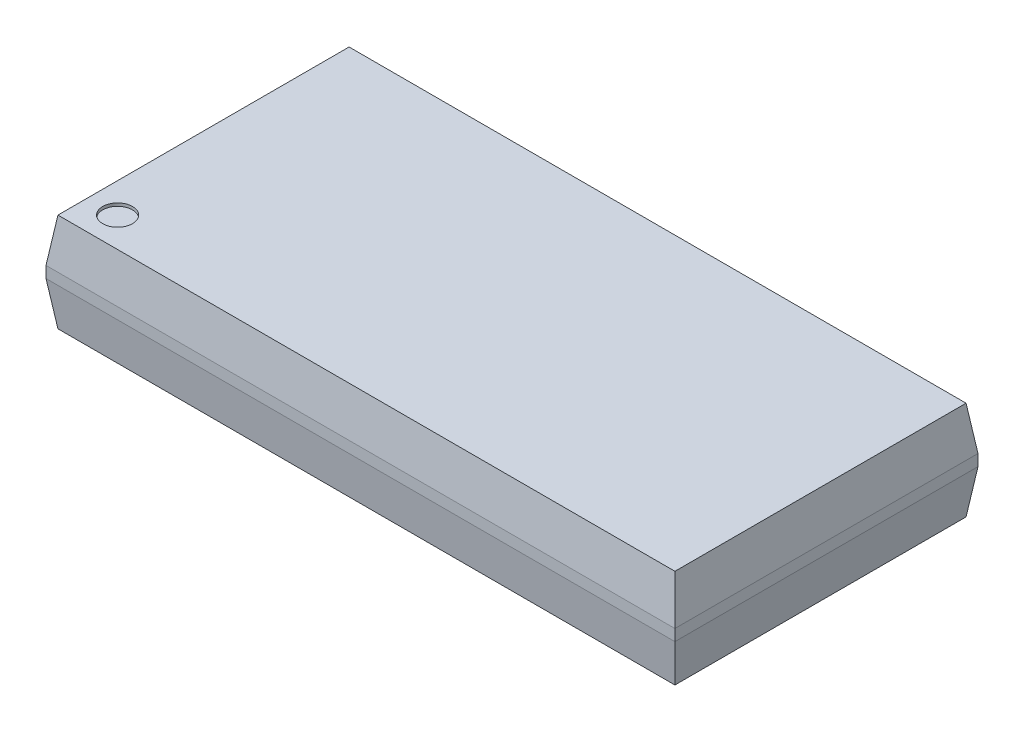
ISO-10303-21;
HEADER;
FILE_DESCRIPTION(('STEP AP214'),'2;1');
FILE_NAME('part.step','',(''),(''),'','','');
FILE_SCHEMA(('AUTOMOTIVE_DESIGN { 1 0 10303 214 1 1 1 1 }'));
ENDSEC;
DATA;
#1=APPLICATION_CONTEXT('core data for automotive mechanical design processes');
#2=APPLICATION_PROTOCOL_DEFINITION('international standard','automotive_design',2000,#1);
#3=PRODUCT_CONTEXT('',#1,'mechanical');
#4=PRODUCT('Part','Part','',(#3));
#5=PRODUCT_RELATED_PRODUCT_CATEGORY('part','',(#4));
#6=PRODUCT_DEFINITION_FORMATION('','',#4);
#7=PRODUCT_DEFINITION_CONTEXT('part definition',#1,'design');
#8=PRODUCT_DEFINITION('design','',#6,#7);
#9=PRODUCT_DEFINITION_SHAPE('','',#8);
#10=(LENGTH_UNIT() NAMED_UNIT(*) SI_UNIT(.MILLI.,.METRE.));
#11=(NAMED_UNIT(*) PLANE_ANGLE_UNIT() SI_UNIT($,.RADIAN.));
#12=(NAMED_UNIT(*) SI_UNIT($,.STERADIAN.) SOLID_ANGLE_UNIT());
#13=UNCERTAINTY_MEASURE_WITH_UNIT(LENGTH_MEASURE(1.E-05),#10,'distance_accuracy_value','');
#14=(GEOMETRIC_REPRESENTATION_CONTEXT(3) GLOBAL_UNCERTAINTY_ASSIGNED_CONTEXT((#13)) GLOBAL_UNIT_ASSIGNED_CONTEXT((#10,
#11,#12)) REPRESENTATION_CONTEXT('',''));
#15=CARTESIAN_POINT('',(0.,0.,0.));
#16=DIRECTION('',(0.,0.,1.));
#17=DIRECTION('',(1.,0.,0.));
#18=AXIS2_PLACEMENT_3D('',#15,#16,#17);
#19=CARTESIAN_POINT('',(-10.541,1.651,5.08));
#20=DIRECTION('',(1.,0.,0.));
#21=DIRECTION('',(0.,0.,-1.));
#22=AXIS2_PLACEMENT_3D('',#19,#20,#21);
#23=PLANE('',#22);
#24=DIRECTION('',(0.,-1.,0.));
#25=VECTOR('',#24,1.);
#26=CARTESIAN_POINT('',(-10.541,1.651,-5.08));
#27=LINE('',#26,#25);
#28=CARTESIAN_POINT('',(-10.541,0.1905,-5.08));
#29=VERTEX_POINT('',#28);
#30=CARTESIAN_POINT('',(-10.541,-0.1905,-5.08));
#31=VERTEX_POINT('',#30);
#32=EDGE_CURVE('E125',#29,#31,#27,.T.);
#33=ORIENTED_EDGE('',*,*,#32,.T.);
#34=DIRECTION('',(0.,0.,1.));
#35=VECTOR('',#34,1.);
#36=CARTESIAN_POINT('',(-10.541,-0.1905,-5.08));
#37=LINE('',#36,#35);
#38=CARTESIAN_POINT('',(-10.541,-0.1905,5.08));
#39=VERTEX_POINT('',#38);
#40=EDGE_CURVE('E111',#31,#39,#37,.T.);
#41=ORIENTED_EDGE('',*,*,#40,.T.);
#42=DIRECTION('',(0.,-1.,0.));
#43=VECTOR('',#42,1.);
#44=CARTESIAN_POINT('',(-10.541,1.651,5.08));
#45=LINE('',#44,#43);
#46=CARTESIAN_POINT('',(-10.541,0.1905,5.08));
#47=VERTEX_POINT('',#46);
#48=EDGE_CURVE('E123',#47,#39,#45,.T.);
#49=ORIENTED_EDGE('',*,*,#48,.F.);
#50=DIRECTION('',(0.,0.,1.));
#51=VECTOR('',#50,1.);
#52=CARTESIAN_POINT('',(-10.541,0.1905,-5.08));
#53=LINE('',#52,#51);
#54=EDGE_CURVE('E226',#29,#47,#53,.T.);
#55=ORIENTED_EDGE('',*,*,#54,.F.);
#56=EDGE_LOOP('',(#33,#41,#49,#55));
#57=FACE_BOUND('',#56,.T.);
#58=ADVANCED_FACE('F41',(#57),#23,.F.);
#59=CARTESIAN_POINT('',(0.,1.651,0.));
#60=DIRECTION('',(0.,-1.,0.));
#61=DIRECTION('',(0.,0.,-1.));
#62=AXIS2_PLACEMENT_3D('',#59,#60,#61);
#63=PLANE('',#62);
#64=CARTESIAN_POINT('',(-9.341,1.651,3.88));
#65=DIRECTION('',(0.,1.,0.));
#66=DIRECTION('',(0.,0.,1.));
#67=AXIS2_PLACEMENT_3D('',#64,#65,#66);
#68=CIRCLE('',#67,0.500000000000001);
#69=CARTESIAN_POINT('',(-9.341,1.651,4.38));
#70=VERTEX_POINT('',#69);
#71=EDGE_CURVE('E235',#70,#70,#68,.T.);
#72=ORIENTED_EDGE('',*,*,#71,.F.);
#73=EDGE_LOOP('',(#72));
#74=FACE_BOUND('',#73,.T.);
#75=DIRECTION('',(0.,0.,1.));
#76=VECTOR('',#75,1.);
#77=CARTESIAN_POINT('',(-10.341,1.651,-5.08));
#78=LINE('',#77,#76);
#79=CARTESIAN_POINT('',(-10.341,1.651,-4.88));
#80=VERTEX_POINT('',#79);
#81=CARTESIAN_POINT('',(-10.341,1.651,4.88));
#82=VERTEX_POINT('',#81);
#83=EDGE_CURVE('E57',#80,#82,#78,.T.);
#84=ORIENTED_EDGE('',*,*,#83,.T.);
#85=DIRECTION('',(1.,0.,0.));
#86=VECTOR('',#85,1.);
#87=CARTESIAN_POINT('',(-10.541,1.651,4.88));
#88=LINE('',#87,#86);
#89=CARTESIAN_POINT('',(10.341,1.651,4.88));
#90=VERTEX_POINT('',#89);
#91=EDGE_CURVE('E153',#82,#90,#88,.T.);
#92=ORIENTED_EDGE('',*,*,#91,.T.);
#93=DIRECTION('',(0.,0.,1.));
#94=VECTOR('',#93,1.);
#95=CARTESIAN_POINT('',(10.341,1.651,-5.08));
#96=LINE('',#95,#94);
#97=CARTESIAN_POINT('',(10.341,1.651,-4.88));
#98=VERTEX_POINT('',#97);
#99=EDGE_CURVE('E179',#98,#90,#96,.T.);
#100=ORIENTED_EDGE('',*,*,#99,.F.);
#101=DIRECTION('',(1.,0.,0.));
#102=VECTOR('',#101,1.);
#103=CARTESIAN_POINT('',(-10.541,1.651,-4.88));
#104=LINE('',#103,#102);
#105=EDGE_CURVE('E139',#80,#98,#104,.T.);
#106=ORIENTED_EDGE('',*,*,#105,.F.);
#107=EDGE_LOOP('',(#84,#92,#100,#106));
#108=FACE_BOUND('',#107,.T.);
#109=ADVANCED_FACE('F176',(#74,#108),#63,.F.);
#110=CARTESIAN_POINT('',(-10.541,1.651,4.88));
#111=DIRECTION('',(0.,-0.135673213556108,-0.990753641993487));
#112=DIRECTION('',(0.,0.990753641993487,-0.135673213556108));
#113=AXIS2_PLACEMENT_3D('',#110,#111,#112);
#114=PLANE('',#113);
#115=DIRECTION('',(0.134441508505806,0.981759115863646,-0.134441508505805));
#116=VECTOR('',#115,1.);
#117=CARTESIAN_POINT('',(-10.3446149038419,1.62460216469479,4.88361490384187));
#118=LINE('',#117,#116);
#119=EDGE_CURVE('E193',#47,#82,#118,.T.);
#120=ORIENTED_EDGE('',*,*,#119,.F.);
#121=DIRECTION('',(1.,0.,0.));
#122=VECTOR('',#121,1.);
#123=CARTESIAN_POINT('',(-10.541,0.1905,5.08));
#124=LINE('',#123,#122);
#125=CARTESIAN_POINT('',(10.541,0.1905,5.08));
#126=VERTEX_POINT('',#125);
#127=EDGE_CURVE('E145',#47,#126,#124,.T.);
#128=ORIENTED_EDGE('',*,*,#127,.T.);
#129=DIRECTION('',(-0.134441508505806,0.981759115863646,-0.134441508505805));
#130=VECTOR('',#129,1.);
#131=CARTESIAN_POINT('',(9.96356788987104,4.40719798421666,4.50256788987105));
#132=LINE('',#131,#130);
#133=EDGE_CURVE('E192',#126,#90,#132,.T.);
#134=ORIENTED_EDGE('',*,*,#133,.T.);
#135=ORIENTED_EDGE('',*,*,#91,.F.);
#136=EDGE_LOOP('',(#120,#128,#134,#135));
#137=FACE_BOUND('',#136,.T.);
#138=ADVANCED_FACE('F191',(#137),#114,.F.);
#139=CARTESIAN_POINT('',(-10.541,1.651,-4.88));
#140=DIRECTION('',(0.,0.135673213556108,-0.990753641993487));
#141=DIRECTION('',(0.,0.990753641993487,0.135673213556108));
#142=AXIS2_PLACEMENT_3D('',#139,#140,#141);
#143=PLANE('',#142);
#144=DIRECTION('',(1.,0.,0.));
#145=VECTOR('',#144,1.);
#146=CARTESIAN_POINT('',(-10.541,0.1905,-5.08));
#147=LINE('',#146,#145);
#148=CARTESIAN_POINT('',(10.541,0.1905,-5.08));
#149=VERTEX_POINT('',#148);
#150=EDGE_CURVE('E173',#29,#149,#147,.T.);
#151=ORIENTED_EDGE('',*,*,#150,.F.);
#152=DIRECTION('',(0.134441508505806,0.981759115863646,0.134441508505805));
#153=VECTOR('',#152,1.);
#154=CARTESIAN_POINT('',(-10.3446149038419,1.62460216469479,-4.88361490384187));
#155=LINE('',#154,#153);
#156=EDGE_CURVE('E50',#29,#80,#155,.T.);
#157=ORIENTED_EDGE('',*,*,#156,.T.);
#158=ORIENTED_EDGE('',*,*,#105,.T.);
#159=DIRECTION('',(-0.134441508505806,0.981759115863646,0.134441508505805));
#160=VECTOR('',#159,1.);
#161=CARTESIAN_POINT('',(9.96356788987104,4.40719798421666,-4.50256788987105));
#162=LINE('',#161,#160);
#163=EDGE_CURVE('E160',#149,#98,#162,.T.);
#164=ORIENTED_EDGE('',*,*,#163,.F.);
#165=EDGE_LOOP('',(#151,#157,#158,#164));
#166=FACE_BOUND('',#165,.T.);
#167=ADVANCED_FACE('F170',(#166),#143,.T.);
#168=CARTESIAN_POINT('',(10.541,1.651,5.08));
#169=DIRECTION('',(-1.,0.,0.));
#170=DIRECTION('',(0.,0.,1.));
#171=AXIS2_PLACEMENT_3D('',#168,#169,#170);
#172=PLANE('',#171);
#173=DIRECTION('',(0.,0.,1.));
#174=VECTOR('',#173,1.);
#175=CARTESIAN_POINT('',(10.541,-0.1905,-5.08));
#176=LINE('',#175,#174);
#177=CARTESIAN_POINT('',(10.541,-0.1905,-5.08));
#178=VERTEX_POINT('',#177);
#179=CARTESIAN_POINT('',(10.541,-0.1905,5.08));
#180=VERTEX_POINT('',#179);
#181=EDGE_CURVE('E198',#178,#180,#176,.T.);
#182=ORIENTED_EDGE('',*,*,#181,.F.);
#183=DIRECTION('',(0.,-1.,0.));
#184=VECTOR('',#183,1.);
#185=CARTESIAN_POINT('',(10.541,1.651,-5.08));
#186=LINE('',#185,#184);
#187=EDGE_CURVE('E151',#149,#178,#186,.T.);
#188=ORIENTED_EDGE('',*,*,#187,.F.);
#189=DIRECTION('',(0.,0.,1.));
#190=VECTOR('',#189,1.);
#191=CARTESIAN_POINT('',(10.541,0.1905,-5.08));
#192=LINE('',#191,#190);
#193=EDGE_CURVE('E200',#149,#126,#192,.T.);
#194=ORIENTED_EDGE('',*,*,#193,.T.);
#195=DIRECTION('',(0.,-1.,0.));
#196=VECTOR('',#195,1.);
#197=CARTESIAN_POINT('',(10.541,1.651,5.08));
#198=LINE('',#197,#196);
#199=EDGE_CURVE('E147',#126,#180,#198,.T.);
#200=ORIENTED_EDGE('',*,*,#199,.T.);
#201=EDGE_LOOP('',(#182,#188,#194,#200));
#202=FACE_BOUND('',#201,.T.);
#203=ADVANCED_FACE('F43',(#202),#172,.F.);
#204=CARTESIAN_POINT('',(0.,-1.651,0.));
#205=DIRECTION('',(0.,-1.,0.));
#206=DIRECTION('',(0.,0.,-1.));
#207=AXIS2_PLACEMENT_3D('',#204,#205,#206);
#208=PLANE('',#207);
#209=DIRECTION('',(0.,0.,1.));
#210=VECTOR('',#209,1.);
#211=CARTESIAN_POINT('',(-10.341,-1.651,-5.08));
#212=LINE('',#211,#210);
#213=CARTESIAN_POINT('',(-10.341,-1.651,-4.88));
#214=VERTEX_POINT('',#213);
#215=CARTESIAN_POINT('',(-10.341,-1.651,4.88));
#216=VERTEX_POINT('',#215);
#217=EDGE_CURVE('E112',#214,#216,#212,.T.);
#218=ORIENTED_EDGE('',*,*,#217,.F.);
#219=DIRECTION('',(1.,0.,0.));
#220=VECTOR('',#219,1.);
#221=CARTESIAN_POINT('',(-10.541,-1.651,-4.88));
#222=LINE('',#221,#220);
#223=CARTESIAN_POINT('',(10.341,-1.651,-4.88));
#224=VERTEX_POINT('',#223);
#225=EDGE_CURVE('E65',#214,#224,#222,.T.);
#226=ORIENTED_EDGE('',*,*,#225,.T.);
#227=DIRECTION('',(0.,0.,1.));
#228=VECTOR('',#227,1.);
#229=CARTESIAN_POINT('',(10.341,-1.651,-5.08));
#230=LINE('',#229,#228);
#231=CARTESIAN_POINT('',(10.341,-1.651,4.88));
#232=VERTEX_POINT('',#231);
#233=EDGE_CURVE('E218',#224,#232,#230,.T.);
#234=ORIENTED_EDGE('',*,*,#233,.T.);
#235=DIRECTION('',(1.,0.,0.));
#236=VECTOR('',#235,1.);
#237=CARTESIAN_POINT('',(-10.541,-1.651,4.88));
#238=LINE('',#237,#236);
#239=EDGE_CURVE('E140',#216,#232,#238,.T.);
#240=ORIENTED_EDGE('',*,*,#239,.F.);
#241=EDGE_LOOP('',(#218,#226,#234,#240));
#242=FACE_BOUND('',#241,.T.);
#243=ADVANCED_FACE('F220',(#242),#208,.T.);
#244=CARTESIAN_POINT('',(-10.541,-1.651,4.88));
#245=DIRECTION('',(0.,-0.135673213556108,0.990753641993487));
#246=DIRECTION('',(0.,-0.990753641993487,-0.135673213556108));
#247=AXIS2_PLACEMENT_3D('',#244,#245,#246);
#248=PLANE('',#247);
#249=DIRECTION('',(-0.134441508505806,0.981759115863646,0.134441508505805));
#250=VECTOR('',#249,1.);
#251=CARTESIAN_POINT('',(-10.3446149038419,-1.62460216469479,4.88361490384187));
#252=LINE('',#251,#250);
#253=EDGE_CURVE('E108',#216,#39,#252,.T.);
#254=ORIENTED_EDGE('',*,*,#253,.F.);
#255=ORIENTED_EDGE('',*,*,#239,.T.);
#256=DIRECTION('',(0.134441508505806,0.981759115863646,0.134441508505805));
#257=VECTOR('',#256,1.);
#258=CARTESIAN_POINT('',(9.96356788987104,-4.40719798421666,4.50256788987105));
#259=LINE('',#258,#257);
#260=EDGE_CURVE('E134',#232,#180,#259,.T.);
#261=ORIENTED_EDGE('',*,*,#260,.T.);
#262=DIRECTION('',(1.,0.,0.));
#263=VECTOR('',#262,1.);
#264=CARTESIAN_POINT('',(-10.541,-0.1905,5.08));
#265=LINE('',#264,#263);
#266=EDGE_CURVE('E131',#39,#180,#265,.T.);
#267=ORIENTED_EDGE('',*,*,#266,.F.);
#268=EDGE_LOOP('',(#254,#255,#261,#267));
#269=FACE_BOUND('',#268,.T.);
#270=ADVANCED_FACE('F132',(#269),#248,.T.);
#271=CARTESIAN_POINT('',(-10.541,-1.651,-4.88));
#272=DIRECTION('',(0.,0.135673213556108,0.990753641993487));
#273=DIRECTION('',(0.,-0.990753641993487,0.135673213556108));
#274=AXIS2_PLACEMENT_3D('',#271,#272,#273);
#275=PLANE('',#274);
#276=ORIENTED_EDGE('',*,*,#225,.F.);
#277=DIRECTION('',(-0.134441508505806,0.981759115863646,-0.134441508505805));
#278=VECTOR('',#277,1.);
#279=CARTESIAN_POINT('',(-10.3446149038419,-1.62460216469479,-4.88361490384187));
#280=LINE('',#279,#278);
#281=EDGE_CURVE('E11',#214,#31,#280,.T.);
#282=ORIENTED_EDGE('',*,*,#281,.T.);
#283=DIRECTION('',(1.,0.,0.));
#284=VECTOR('',#283,1.);
#285=CARTESIAN_POINT('',(-10.541,-0.1905,-5.08));
#286=LINE('',#285,#284);
#287=EDGE_CURVE('E211',#31,#178,#286,.T.);
#288=ORIENTED_EDGE('',*,*,#287,.T.);
#289=DIRECTION('',(0.134441508505806,0.981759115863646,-0.134441508505805));
#290=VECTOR('',#289,1.);
#291=CARTESIAN_POINT('',(9.96356788987104,-4.40719798421666,-4.50256788987105));
#292=LINE('',#291,#290);
#293=EDGE_CURVE('E164',#224,#178,#292,.T.);
#294=ORIENTED_EDGE('',*,*,#293,.F.);
#295=EDGE_LOOP('',(#276,#282,#288,#294));
#296=FACE_BOUND('',#295,.T.);
#297=ADVANCED_FACE('F265',(#296),#275,.F.);
#298=CARTESIAN_POINT('',(-10.541,1.651,5.08));
#299=DIRECTION('',(0.,0.,-1.));
#300=DIRECTION('',(-1.,0.,0.));
#301=AXIS2_PLACEMENT_3D('',#298,#299,#300);
#302=PLANE('',#301);
#303=ORIENTED_EDGE('',*,*,#266,.T.);
#304=ORIENTED_EDGE('',*,*,#199,.F.);
#305=ORIENTED_EDGE('',*,*,#127,.F.);
#306=ORIENTED_EDGE('',*,*,#48,.T.);
#307=EDGE_LOOP('',(#303,#304,#305,#306));
#308=FACE_BOUND('',#307,.T.);
#309=ADVANCED_FACE('F143',(#308),#302,.F.);
#310=CARTESIAN_POINT('',(-10.541,1.651,-5.08));
#311=DIRECTION('',(0.,0.,1.));
#312=DIRECTION('',(1.,0.,0.));
#313=AXIS2_PLACEMENT_3D('',#310,#311,#312);
#314=PLANE('',#313);
#315=ORIENTED_EDGE('',*,*,#187,.T.);
#316=ORIENTED_EDGE('',*,*,#287,.F.);
#317=ORIENTED_EDGE('',*,*,#32,.F.);
#318=ORIENTED_EDGE('',*,*,#150,.T.);
#319=EDGE_LOOP('',(#315,#316,#317,#318));
#320=FACE_BOUND('',#319,.T.);
#321=ADVANCED_FACE('F264',(#320),#314,.F.);
#322=CARTESIAN_POINT('',(10.341,1.651,-5.08));
#323=DIRECTION('',(-0.990753641993487,-0.135673213556109,0.));
#324=DIRECTION('',(0.13567321355611,-0.990753641993487,0.));
#325=AXIS2_PLACEMENT_3D('',#322,#323,#324);
#326=PLANE('',#325);
#327=ORIENTED_EDGE('',*,*,#193,.F.);
#328=ORIENTED_EDGE('',*,*,#163,.T.);
#329=ORIENTED_EDGE('',*,*,#99,.T.);
#330=ORIENTED_EDGE('',*,*,#133,.F.);
#331=EDGE_LOOP('',(#327,#328,#329,#330));
#332=FACE_BOUND('',#331,.T.);
#333=ADVANCED_FACE('F267',(#332),#326,.F.);
#334=CARTESIAN_POINT('',(10.341,-1.651,-5.08));
#335=DIRECTION('',(0.990753641993487,-0.135673213556109,0.));
#336=DIRECTION('',(0.13567321355611,0.990753641993487,0.));
#337=AXIS2_PLACEMENT_3D('',#334,#335,#336);
#338=PLANE('',#337);
#339=ORIENTED_EDGE('',*,*,#233,.F.);
#340=ORIENTED_EDGE('',*,*,#293,.T.);
#341=ORIENTED_EDGE('',*,*,#181,.T.);
#342=ORIENTED_EDGE('',*,*,#260,.F.);
#343=EDGE_LOOP('',(#339,#340,#341,#342));
#344=FACE_BOUND('',#343,.T.);
#345=ADVANCED_FACE('F217',(#344),#338,.T.);
#346=CARTESIAN_POINT('',(-10.341,1.651,-5.08));
#347=DIRECTION('',(-0.990753641993487,0.135673213556109,0.));
#348=DIRECTION('',(-0.13567321355611,-0.990753641993487,0.));
#349=AXIS2_PLACEMENT_3D('',#346,#347,#348);
#350=PLANE('',#349);
#351=ORIENTED_EDGE('',*,*,#119,.T.);
#352=ORIENTED_EDGE('',*,*,#83,.F.);
#353=ORIENTED_EDGE('',*,*,#156,.F.);
#354=ORIENTED_EDGE('',*,*,#54,.T.);
#355=EDGE_LOOP('',(#351,#352,#353,#354));
#356=FACE_BOUND('',#355,.T.);
#357=ADVANCED_FACE('F318',(#356),#350,.T.);
#358=CARTESIAN_POINT('',(-10.341,-1.651,-5.08));
#359=DIRECTION('',(0.990753641993487,0.135673213556109,0.));
#360=DIRECTION('',(-0.13567321355611,0.990753641993487,0.));
#361=AXIS2_PLACEMENT_3D('',#358,#359,#360);
#362=PLANE('',#361);
#363=ORIENTED_EDGE('',*,*,#253,.T.);
#364=ORIENTED_EDGE('',*,*,#40,.F.);
#365=ORIENTED_EDGE('',*,*,#281,.F.);
#366=ORIENTED_EDGE('',*,*,#217,.T.);
#367=EDGE_LOOP('',(#363,#364,#365,#366));
#368=FACE_BOUND('',#367,.T.);
#369=ADVANCED_FACE('F110',(#368),#362,.F.);
#370=CARTESIAN_POINT('',(-9.341,1.551,3.88));
#371=DIRECTION('',(0.,1.,0.));
#372=DIRECTION('',(0.,0.,1.));
#373=AXIS2_PLACEMENT_3D('',#370,#371,#372);
#374=CYLINDRICAL_SURFACE('',#373,0.500000000000001);
#375=CARTESIAN_POINT('',(-9.341,1.551,3.88));
#376=DIRECTION('',(0.,1.,0.));
#377=DIRECTION('',(0.,0.,1.));
#378=AXIS2_PLACEMENT_3D('',#375,#376,#377);
#379=CIRCLE('',#378,0.500000000000001);
#380=CARTESIAN_POINT('',(-9.341,1.551,4.38));
#381=VERTEX_POINT('',#380);
#382=EDGE_CURVE('E127',#381,#381,#379,.T.);
#383=ORIENTED_EDGE('',*,*,#382,.F.);
#384=EDGE_LOOP('',(#383));
#385=FACE_BOUND('',#384,.T.);
#386=ORIENTED_EDGE('',*,*,#71,.T.);
#387=EDGE_LOOP('',(#386));
#388=FACE_BOUND('',#387,.T.);
#389=ADVANCED_FACE('F245',(#385,#388),#374,.F.);
#390=CARTESIAN_POINT('',(-9.341,1.551,3.88));
#391=DIRECTION('',(0.,1.,0.));
#392=DIRECTION('',(0.,0.,1.));
#393=AXIS2_PLACEMENT_3D('',#390,#391,#392);
#394=PLANE('',#393);
#395=ORIENTED_EDGE('',*,*,#382,.T.);
#396=EDGE_LOOP('',(#395));
#397=FACE_BOUND('',#396,.T.);
#398=ADVANCED_FACE('F243',(#397),#394,.T.);
#399=CLOSED_SHELL('',(#58,#109,#138,#167,#203,#243,#270,#297,#309,#321,#333,#345,#357,#369,#389,#398));
#400=MANIFOLD_SOLID_BREP('B2',#399);
#401=ADVANCED_BREP_SHAPE_REPRESENTATION('',(#18,#400),#14);
#402=SHAPE_DEFINITION_REPRESENTATION(#9,#401);
ENDSEC;
END-ISO-10303-21;
